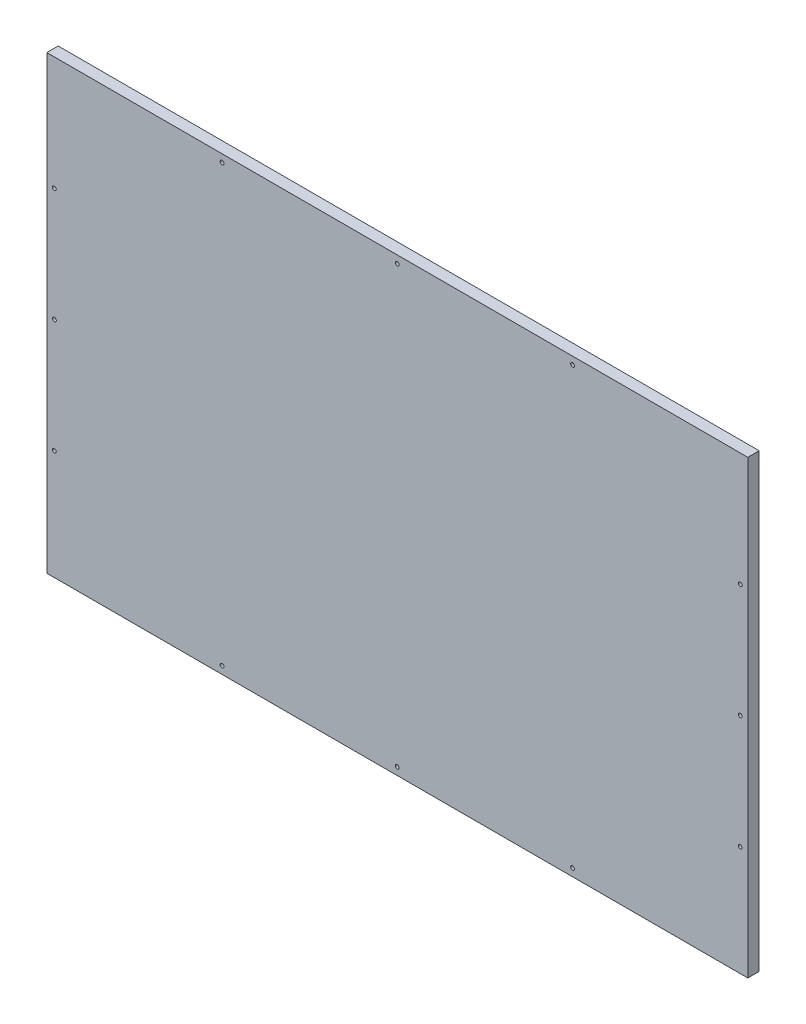
ISO-10303-21;
HEADER;
FILE_DESCRIPTION(('STEP AP214'),'2;1');
FILE_NAME('part.step','',(''),(''),'','','');
FILE_SCHEMA(('AUTOMOTIVE_DESIGN { 1 0 10303 214 1 1 1 1 }'));
ENDSEC;
DATA;
#1=APPLICATION_CONTEXT('core data for automotive mechanical design processes');
#2=APPLICATION_PROTOCOL_DEFINITION('international standard','automotive_design',2000,#1);
#3=PRODUCT_CONTEXT('',#1,'mechanical');
#4=PRODUCT('Part','Part','',(#3));
#5=PRODUCT_RELATED_PRODUCT_CATEGORY('part','',(#4));
#6=PRODUCT_DEFINITION_FORMATION('','',#4);
#7=PRODUCT_DEFINITION_CONTEXT('part definition',#1,'design');
#8=PRODUCT_DEFINITION('design','',#6,#7);
#9=PRODUCT_DEFINITION_SHAPE('','',#8);
#10=(LENGTH_UNIT() NAMED_UNIT(*) SI_UNIT(.MILLI.,.METRE.));
#11=(NAMED_UNIT(*) PLANE_ANGLE_UNIT() SI_UNIT($,.RADIAN.));
#12=(NAMED_UNIT(*) SI_UNIT($,.STERADIAN.) SOLID_ANGLE_UNIT());
#13=UNCERTAINTY_MEASURE_WITH_UNIT(LENGTH_MEASURE(1.E-05),#10,'distance_accuracy_value','');
#14=(GEOMETRIC_REPRESENTATION_CONTEXT(3) GLOBAL_UNCERTAINTY_ASSIGNED_CONTEXT((#13)) GLOBAL_UNIT_ASSIGNED_CONTEXT((#10,
#11,#12)) REPRESENTATION_CONTEXT('',''));
#15=CARTESIAN_POINT('',(0.,0.,0.));
#16=DIRECTION('',(0.,0.,1.));
#17=DIRECTION('',(1.,0.,0.));
#18=AXIS2_PLACEMENT_3D('',#15,#16,#17);
#19=CARTESIAN_POINT('',(462.5,297.5,15.));
#20=DIRECTION('',(-1.,0.,0.));
#21=DIRECTION('',(0.,-1.,0.));
#22=AXIS2_PLACEMENT_3D('',#19,#20,#21);
#23=PLANE('',#22);
#24=DIRECTION('',(0.,1.,0.));
#25=VECTOR('',#24,1.);
#26=CARTESIAN_POINT('',(462.5,297.5,0.));
#27=LINE('',#26,#25);
#28=CARTESIAN_POINT('',(462.5,-297.5,0.));
#29=VERTEX_POINT('',#28);
#30=CARTESIAN_POINT('',(462.5,297.5,0.));
#31=VERTEX_POINT('',#30);
#32=EDGE_CURVE('E100',#29,#31,#27,.T.);
#33=ORIENTED_EDGE('',*,*,#32,.T.);
#34=DIRECTION('',(0.,0.,-1.));
#35=VECTOR('',#34,1.);
#36=CARTESIAN_POINT('',(462.5,297.5,15.));
#37=LINE('',#36,#35);
#38=CARTESIAN_POINT('',(462.5,297.5,15.));
#39=VERTEX_POINT('',#38);
#40=EDGE_CURVE('E11',#39,#31,#37,.T.);
#41=ORIENTED_EDGE('',*,*,#40,.F.);
#42=DIRECTION('',(0.,1.,0.));
#43=VECTOR('',#42,1.);
#44=CARTESIAN_POINT('',(462.5,297.5,15.));
#45=LINE('',#44,#43);
#46=CARTESIAN_POINT('',(462.5,-297.5,15.));
#47=VERTEX_POINT('',#46);
#48=EDGE_CURVE('E88',#47,#39,#45,.T.);
#49=ORIENTED_EDGE('',*,*,#48,.F.);
#50=DIRECTION('',(0.,0.,-1.));
#51=VECTOR('',#50,1.);
#52=CARTESIAN_POINT('',(462.5,-297.5,15.));
#53=LINE('',#52,#51);
#54=EDGE_CURVE('E96',#47,#29,#53,.T.);
#55=ORIENTED_EDGE('',*,*,#54,.T.);
#56=EDGE_LOOP('',(#33,#41,#49,#55));
#57=FACE_BOUND('',#56,.T.);
#58=ADVANCED_FACE('F37',(#57),#23,.F.);
#59=CARTESIAN_POINT('',(-462.5,297.5,15.));
#60=DIRECTION('',(0.,-1.,0.));
#61=DIRECTION('',(0.,0.,-1.));
#62=AXIS2_PLACEMENT_3D('',#59,#60,#61);
#63=PLANE('',#62);
#64=DIRECTION('',(-1.,0.,0.));
#65=VECTOR('',#64,1.);
#66=CARTESIAN_POINT('',(-462.5,297.5,0.));
#67=LINE('',#66,#65);
#68=CARTESIAN_POINT('',(-462.5,297.5,0.));
#69=VERTEX_POINT('',#68);
#70=EDGE_CURVE('E92',#31,#69,#67,.T.);
#71=ORIENTED_EDGE('',*,*,#70,.T.);
#72=DIRECTION('',(0.,0.,-1.));
#73=VECTOR('',#72,1.);
#74=CARTESIAN_POINT('',(-462.5,297.5,15.));
#75=LINE('',#74,#73);
#76=CARTESIAN_POINT('',(-462.5,297.5,15.));
#77=VERTEX_POINT('',#76);
#78=EDGE_CURVE('E45',#77,#69,#75,.T.);
#79=ORIENTED_EDGE('',*,*,#78,.F.);
#80=DIRECTION('',(-1.,0.,0.));
#81=VECTOR('',#80,1.);
#82=CARTESIAN_POINT('',(-462.5,297.5,15.));
#83=LINE('',#82,#81);
#84=EDGE_CURVE('E83',#39,#77,#83,.T.);
#85=ORIENTED_EDGE('',*,*,#84,.F.);
#86=ORIENTED_EDGE('',*,*,#40,.T.);
#87=EDGE_LOOP('',(#71,#79,#85,#86));
#88=FACE_BOUND('',#87,.T.);
#89=ADVANCED_FACE('F91',(#88),#63,.F.);
#90=CARTESIAN_POINT('',(-462.5,297.5,15.));
#91=DIRECTION('',(1.,0.,0.));
#92=DIRECTION('',(0.,1.,0.));
#93=AXIS2_PLACEMENT_3D('',#90,#91,#92);
#94=PLANE('',#93);
#95=DIRECTION('',(0.,-1.,0.));
#96=VECTOR('',#95,1.);
#97=CARTESIAN_POINT('',(-462.5,297.5,0.));
#98=LINE('',#97,#96);
#99=CARTESIAN_POINT('',(-462.5,-297.5,0.));
#100=VERTEX_POINT('',#99);
#101=EDGE_CURVE('E70',#69,#100,#98,.T.);
#102=ORIENTED_EDGE('',*,*,#101,.T.);
#103=DIRECTION('',(0.,0.,-1.));
#104=VECTOR('',#103,1.);
#105=CARTESIAN_POINT('',(-462.5,-297.5,15.));
#106=LINE('',#105,#104);
#107=CARTESIAN_POINT('',(-462.5,-297.5,15.));
#108=VERTEX_POINT('',#107);
#109=EDGE_CURVE('E93',#108,#100,#106,.T.);
#110=ORIENTED_EDGE('',*,*,#109,.F.);
#111=DIRECTION('',(0.,-1.,0.));
#112=VECTOR('',#111,1.);
#113=CARTESIAN_POINT('',(-462.5,297.5,15.));
#114=LINE('',#113,#112);
#115=EDGE_CURVE('E86',#77,#108,#114,.T.);
#116=ORIENTED_EDGE('',*,*,#115,.F.);
#117=ORIENTED_EDGE('',*,*,#78,.T.);
#118=EDGE_LOOP('',(#102,#110,#116,#117));
#119=FACE_BOUND('',#118,.T.);
#120=ADVANCED_FACE('F94',(#119),#94,.F.);
#121=CARTESIAN_POINT('',(-462.5,-297.5,15.));
#122=DIRECTION('',(0.,1.,0.));
#123=DIRECTION('',(0.,0.,1.));
#124=AXIS2_PLACEMENT_3D('',#121,#122,#123);
#125=PLANE('',#124);
#126=DIRECTION('',(1.,0.,0.));
#127=VECTOR('',#126,1.);
#128=CARTESIAN_POINT('',(-462.5,-297.5,0.));
#129=LINE('',#128,#127);
#130=EDGE_CURVE('E76',#100,#29,#129,.T.);
#131=ORIENTED_EDGE('',*,*,#130,.T.);
#132=ORIENTED_EDGE('',*,*,#54,.F.);
#133=DIRECTION('',(1.,0.,0.));
#134=VECTOR('',#133,1.);
#135=CARTESIAN_POINT('',(-462.5,-297.5,15.));
#136=LINE('',#135,#134);
#137=EDGE_CURVE('E53',#108,#47,#136,.T.);
#138=ORIENTED_EDGE('',*,*,#137,.F.);
#139=ORIENTED_EDGE('',*,*,#109,.T.);
#140=EDGE_LOOP('',(#131,#132,#138,#139));
#141=FACE_BOUND('',#140,.T.);
#142=ADVANCED_FACE('F108',(#141),#125,.F.);
#143=CARTESIAN_POINT('',(0.,0.,15.));
#144=DIRECTION('',(0.,0.,1.));
#145=DIRECTION('',(1.,0.,0.));
#146=AXIS2_PLACEMENT_3D('',#143,#144,#145);
#147=PLANE('',#146);
#148=CARTESIAN_POINT('',(452.5,147.5,15.));
#149=DIRECTION('',(0.,0.,-1.));
#150=DIRECTION('',(-1.,0.,0.));
#151=AXIS2_PLACEMENT_3D('',#148,#149,#150);
#152=CIRCLE('',#151,2.50000000000002);
#153=CARTESIAN_POINT('',(450.,147.5,15.));
#154=VERTEX_POINT('',#153);
#155=EDGE_CURVE('E180',#154,#154,#152,.T.);
#156=ORIENTED_EDGE('',*,*,#155,.T.);
#157=EDGE_LOOP('',(#156));
#158=FACE_BOUND('',#157,.T.);
#159=CARTESIAN_POINT('',(452.5,-2.5,15.));
#160=DIRECTION('',(0.,0.,-1.));
#161=DIRECTION('',(-1.,0.,0.));
#162=AXIS2_PLACEMENT_3D('',#159,#160,#161);
#163=CIRCLE('',#162,2.50000000000002);
#164=CARTESIAN_POINT('',(450.,-2.5,15.));
#165=VERTEX_POINT('',#164);
#166=EDGE_CURVE('E174',#165,#165,#163,.T.);
#167=ORIENTED_EDGE('',*,*,#166,.T.);
#168=EDGE_LOOP('',(#167));
#169=FACE_BOUND('',#168,.T.);
#170=CARTESIAN_POINT('',(452.5,-152.5,15.));
#171=DIRECTION('',(0.,0.,-1.));
#172=DIRECTION('',(-1.,0.,0.));
#173=AXIS2_PLACEMENT_3D('',#170,#171,#172);
#174=CIRCLE('',#173,2.50000000000002);
#175=CARTESIAN_POINT('',(450.,-152.5,15.));
#176=VERTEX_POINT('',#175);
#177=EDGE_CURVE('E168',#176,#176,#174,.T.);
#178=ORIENTED_EDGE('',*,*,#177,.T.);
#179=EDGE_LOOP('',(#178));
#180=FACE_BOUND('',#179,.T.);
#181=CARTESIAN_POINT('',(-231.25,-287.5,15.));
#182=DIRECTION('',(0.,0.,-1.));
#183=DIRECTION('',(1.,0.,0.));
#184=AXIS2_PLACEMENT_3D('',#181,#182,#183);
#185=CIRCLE('',#184,2.50000000000002);
#186=CARTESIAN_POINT('',(-228.75,-287.5,15.));
#187=VERTEX_POINT('',#186);
#188=EDGE_CURVE('E163',#187,#187,#185,.T.);
#189=ORIENTED_EDGE('',*,*,#188,.T.);
#190=EDGE_LOOP('',(#189));
#191=FACE_BOUND('',#190,.T.);
#192=CARTESIAN_POINT('',(0.,-287.5,15.));
#193=DIRECTION('',(0.,0.,-1.));
#194=DIRECTION('',(1.,0.,0.));
#195=AXIS2_PLACEMENT_3D('',#192,#193,#194);
#196=CIRCLE('',#195,2.49999999999993);
#197=CARTESIAN_POINT('',(2.49999999999985,-287.5,15.));
#198=VERTEX_POINT('',#197);
#199=EDGE_CURVE('E157',#198,#198,#196,.T.);
#200=ORIENTED_EDGE('',*,*,#199,.T.);
#201=EDGE_LOOP('',(#200));
#202=FACE_BOUND('',#201,.T.);
#203=CARTESIAN_POINT('',(231.25,-287.5,15.));
#204=DIRECTION('',(0.,0.,-1.));
#205=DIRECTION('',(1.,0.,0.));
#206=AXIS2_PLACEMENT_3D('',#203,#204,#205);
#207=CIRCLE('',#206,2.49999999999992);
#208=CARTESIAN_POINT('',(233.75,-287.5,15.));
#209=VERTEX_POINT('',#208);
#210=EDGE_CURVE('E150',#209,#209,#207,.T.);
#211=ORIENTED_EDGE('',*,*,#210,.T.);
#212=EDGE_LOOP('',(#211));
#213=FACE_BOUND('',#212,.T.);
#214=CARTESIAN_POINT('',(-452.5,147.5,15.));
#215=DIRECTION('',(0.,0.,1.));
#216=DIRECTION('',(1.,0.,0.));
#217=AXIS2_PLACEMENT_3D('',#214,#215,#216);
#218=CIRCLE('',#217,2.50000000000002);
#219=CARTESIAN_POINT('',(-450.,147.5,15.));
#220=VERTEX_POINT('',#219);
#221=EDGE_CURVE('E145',#220,#220,#218,.T.);
#222=ORIENTED_EDGE('',*,*,#221,.F.);
#223=EDGE_LOOP('',(#222));
#224=FACE_BOUND('',#223,.T.);
#225=CARTESIAN_POINT('',(-452.5,-2.5,15.));
#226=DIRECTION('',(0.,0.,1.));
#227=DIRECTION('',(1.,0.,0.));
#228=AXIS2_PLACEMENT_3D('',#225,#226,#227);
#229=CIRCLE('',#228,2.50000000000002);
#230=CARTESIAN_POINT('',(-450.,-2.5,15.));
#231=VERTEX_POINT('',#230);
#232=EDGE_CURVE('E142',#231,#231,#229,.T.);
#233=ORIENTED_EDGE('',*,*,#232,.F.);
#234=EDGE_LOOP('',(#233));
#235=FACE_BOUND('',#234,.T.);
#236=CARTESIAN_POINT('',(-452.5,-152.5,15.));
#237=DIRECTION('',(0.,0.,1.));
#238=DIRECTION('',(1.,0.,0.));
#239=AXIS2_PLACEMENT_3D('',#236,#237,#238);
#240=CIRCLE('',#239,2.50000000000002);
#241=CARTESIAN_POINT('',(-450.,-152.5,15.));
#242=VERTEX_POINT('',#241);
#243=EDGE_CURVE('E135',#242,#242,#240,.T.);
#244=ORIENTED_EDGE('',*,*,#243,.F.);
#245=EDGE_LOOP('',(#244));
#246=FACE_BOUND('',#245,.T.);
#247=CARTESIAN_POINT('',(-231.25,287.5,15.));
#248=DIRECTION('',(0.,0.,1.));
#249=DIRECTION('',(1.,0.,0.));
#250=AXIS2_PLACEMENT_3D('',#247,#248,#249);
#251=CIRCLE('',#250,2.50000000000002);
#252=CARTESIAN_POINT('',(-228.75,287.5,15.));
#253=VERTEX_POINT('',#252);
#254=EDGE_CURVE('E127',#253,#253,#251,.T.);
#255=ORIENTED_EDGE('',*,*,#254,.F.);
#256=EDGE_LOOP('',(#255));
#257=FACE_BOUND('',#256,.T.);
#258=CARTESIAN_POINT('',(0.,287.5,15.));
#259=DIRECTION('',(0.,0.,1.));
#260=DIRECTION('',(1.,0.,0.));
#261=AXIS2_PLACEMENT_3D('',#258,#259,#260);
#262=CIRCLE('',#261,2.49999999999993);
#263=CARTESIAN_POINT('',(2.49999999999985,287.5,15.));
#264=VERTEX_POINT('',#263);
#265=EDGE_CURVE('E124',#264,#264,#262,.T.);
#266=ORIENTED_EDGE('',*,*,#265,.F.);
#267=EDGE_LOOP('',(#266));
#268=FACE_BOUND('',#267,.T.);
#269=CARTESIAN_POINT('',(231.25,287.5,15.));
#270=DIRECTION('',(0.,0.,1.));
#271=DIRECTION('',(1.,0.,0.));
#272=AXIS2_PLACEMENT_3D('',#269,#270,#271);
#273=CIRCLE('',#272,2.49999999999992);
#274=CARTESIAN_POINT('',(233.75,287.5,15.));
#275=VERTEX_POINT('',#274);
#276=EDGE_CURVE('E117',#275,#275,#273,.T.);
#277=ORIENTED_EDGE('',*,*,#276,.F.);
#278=EDGE_LOOP('',(#277));
#279=FACE_BOUND('',#278,.T.);
#280=ORIENTED_EDGE('',*,*,#48,.T.);
#281=ORIENTED_EDGE('',*,*,#84,.T.);
#282=ORIENTED_EDGE('',*,*,#115,.T.);
#283=ORIENTED_EDGE('',*,*,#137,.T.);
#284=EDGE_LOOP('',(#280,#281,#282,#283));
#285=FACE_BOUND('',#284,.T.);
#286=ADVANCED_FACE('F84',(#158,#169,#180,#191,#202,#213,#224,#235,#246,#257,#268,#279,#285),
#147,.T.);
#287=CARTESIAN_POINT('',(0.,0.,0.));
#288=DIRECTION('',(0.,0.,1.));
#289=DIRECTION('',(1.,0.,0.));
#290=AXIS2_PLACEMENT_3D('',#287,#288,#289);
#291=PLANE('',#290);
#292=CARTESIAN_POINT('',(452.5,147.5,0.));
#293=DIRECTION('',(0.,0.,-1.));
#294=DIRECTION('',(-1.,0.,0.));
#295=AXIS2_PLACEMENT_3D('',#292,#293,#294);
#296=CIRCLE('',#295,2.50000000000002);
#297=CARTESIAN_POINT('',(450.,147.5,0.));
#298=VERTEX_POINT('',#297);
#299=EDGE_CURVE('E154',#298,#298,#296,.T.);
#300=ORIENTED_EDGE('',*,*,#299,.F.);
#301=EDGE_LOOP('',(#300));
#302=FACE_BOUND('',#301,.T.);
#303=CARTESIAN_POINT('',(452.5,-2.5,0.));
#304=DIRECTION('',(0.,0.,-1.));
#305=DIRECTION('',(-1.,0.,0.));
#306=AXIS2_PLACEMENT_3D('',#303,#304,#305);
#307=CIRCLE('',#306,2.50000000000002);
#308=CARTESIAN_POINT('',(450.,-2.5,0.));
#309=VERTEX_POINT('',#308);
#310=EDGE_CURVE('E177',#309,#309,#307,.T.);
#311=ORIENTED_EDGE('',*,*,#310,.F.);
#312=EDGE_LOOP('',(#311));
#313=FACE_BOUND('',#312,.T.);
#314=CARTESIAN_POINT('',(452.5,-152.5,0.));
#315=DIRECTION('',(0.,0.,-1.));
#316=DIRECTION('',(-1.,0.,0.));
#317=AXIS2_PLACEMENT_3D('',#314,#315,#316);
#318=CIRCLE('',#317,2.50000000000002);
#319=CARTESIAN_POINT('',(450.,-152.5,0.));
#320=VERTEX_POINT('',#319);
#321=EDGE_CURVE('E171',#320,#320,#318,.T.);
#322=ORIENTED_EDGE('',*,*,#321,.F.);
#323=EDGE_LOOP('',(#322));
#324=FACE_BOUND('',#323,.T.);
#325=CARTESIAN_POINT('',(-231.25,-287.5,0.));
#326=DIRECTION('',(0.,0.,-1.));
#327=DIRECTION('',(1.,0.,0.));
#328=AXIS2_PLACEMENT_3D('',#325,#326,#327);
#329=CIRCLE('',#328,2.50000000000002);
#330=CARTESIAN_POINT('',(-228.75,-287.5,0.));
#331=VERTEX_POINT('',#330);
#332=EDGE_CURVE('E136',#331,#331,#329,.T.);
#333=ORIENTED_EDGE('',*,*,#332,.F.);
#334=EDGE_LOOP('',(#333));
#335=FACE_BOUND('',#334,.T.);
#336=CARTESIAN_POINT('',(0.,-287.5,0.));
#337=DIRECTION('',(0.,0.,-1.));
#338=DIRECTION('',(1.,0.,0.));
#339=AXIS2_PLACEMENT_3D('',#336,#337,#338);
#340=CIRCLE('',#339,2.49999999999993);
#341=CARTESIAN_POINT('',(2.49999999999985,-287.5,0.));
#342=VERTEX_POINT('',#341);
#343=EDGE_CURVE('E160',#342,#342,#340,.T.);
#344=ORIENTED_EDGE('',*,*,#343,.F.);
#345=EDGE_LOOP('',(#344));
#346=FACE_BOUND('',#345,.T.);
#347=CARTESIAN_POINT('',(231.25,-287.5,0.));
#348=DIRECTION('',(0.,0.,-1.));
#349=DIRECTION('',(1.,0.,0.));
#350=AXIS2_PLACEMENT_3D('',#347,#348,#349);
#351=CIRCLE('',#350,2.49999999999992);
#352=CARTESIAN_POINT('',(233.75,-287.5,0.));
#353=VERTEX_POINT('',#352);
#354=EDGE_CURVE('E153',#353,#353,#351,.T.);
#355=ORIENTED_EDGE('',*,*,#354,.F.);
#356=EDGE_LOOP('',(#355));
#357=FACE_BOUND('',#356,.T.);
#358=CARTESIAN_POINT('',(-452.5,147.5,0.));
#359=DIRECTION('',(0.,0.,1.));
#360=DIRECTION('',(1.,0.,0.));
#361=AXIS2_PLACEMENT_3D('',#358,#359,#360);
#362=CIRCLE('',#361,2.50000000000002);
#363=CARTESIAN_POINT('',(-450.,147.5,0.));
#364=VERTEX_POINT('',#363);
#365=EDGE_CURVE('E118',#364,#364,#362,.T.);
#366=ORIENTED_EDGE('',*,*,#365,.T.);
#367=EDGE_LOOP('',(#366));
#368=FACE_BOUND('',#367,.T.);
#369=CARTESIAN_POINT('',(-452.5,-2.5,0.));
#370=DIRECTION('',(0.,0.,1.));
#371=DIRECTION('',(1.,0.,0.));
#372=AXIS2_PLACEMENT_3D('',#369,#370,#371);
#373=CIRCLE('',#372,2.50000000000002);
#374=CARTESIAN_POINT('',(-450.,-2.5,0.));
#375=VERTEX_POINT('',#374);
#376=EDGE_CURVE('E139',#375,#375,#373,.T.);
#377=ORIENTED_EDGE('',*,*,#376,.T.);
#378=EDGE_LOOP('',(#377));
#379=FACE_BOUND('',#378,.T.);
#380=CARTESIAN_POINT('',(-452.5,-152.5,0.));
#381=DIRECTION('',(0.,0.,1.));
#382=DIRECTION('',(1.,0.,0.));
#383=AXIS2_PLACEMENT_3D('',#380,#381,#382);
#384=CIRCLE('',#383,2.50000000000002);
#385=CARTESIAN_POINT('',(-450.,-152.5,0.));
#386=VERTEX_POINT('',#385);
#387=EDGE_CURVE('E132',#386,#386,#384,.T.);
#388=ORIENTED_EDGE('',*,*,#387,.T.);
#389=EDGE_LOOP('',(#388));
#390=FACE_BOUND('',#389,.T.);
#391=CARTESIAN_POINT('',(-231.25,287.5,0.));
#392=DIRECTION('',(0.,0.,1.));
#393=DIRECTION('',(1.,0.,0.));
#394=AXIS2_PLACEMENT_3D('',#391,#392,#393);
#395=CIRCLE('',#394,2.50000000000002);
#396=CARTESIAN_POINT('',(-228.75,287.5,0.));
#397=VERTEX_POINT('',#396);
#398=EDGE_CURVE('E103',#397,#397,#395,.T.);
#399=ORIENTED_EDGE('',*,*,#398,.T.);
#400=EDGE_LOOP('',(#399));
#401=FACE_BOUND('',#400,.T.);
#402=CARTESIAN_POINT('',(0.,287.5,0.));
#403=DIRECTION('',(0.,0.,1.));
#404=DIRECTION('',(1.,0.,0.));
#405=AXIS2_PLACEMENT_3D('',#402,#403,#404);
#406=CIRCLE('',#405,2.49999999999993);
#407=CARTESIAN_POINT('',(2.49999999999985,287.5,0.));
#408=VERTEX_POINT('',#407);
#409=EDGE_CURVE('E121',#408,#408,#406,.T.);
#410=ORIENTED_EDGE('',*,*,#409,.T.);
#411=EDGE_LOOP('',(#410));
#412=FACE_BOUND('',#411,.T.);
#413=CARTESIAN_POINT('',(231.25,287.5,0.));
#414=DIRECTION('',(0.,0.,1.));
#415=DIRECTION('',(1.,0.,0.));
#416=AXIS2_PLACEMENT_3D('',#413,#414,#415);
#417=CIRCLE('',#416,2.49999999999992);
#418=CARTESIAN_POINT('',(233.75,287.5,0.));
#419=VERTEX_POINT('',#418);
#420=EDGE_CURVE('E114',#419,#419,#417,.T.);
#421=ORIENTED_EDGE('',*,*,#420,.T.);
#422=EDGE_LOOP('',(#421));
#423=FACE_BOUND('',#422,.T.);
#424=ORIENTED_EDGE('',*,*,#32,.F.);
#425=ORIENTED_EDGE('',*,*,#130,.F.);
#426=ORIENTED_EDGE('',*,*,#101,.F.);
#427=ORIENTED_EDGE('',*,*,#70,.F.);
#428=EDGE_LOOP('',(#424,#425,#426,#427));
#429=FACE_BOUND('',#428,.T.);
#430=ADVANCED_FACE('F111',(#302,#313,#324,#335,#346,#357,#368,#379,#390,#401,#412,#423,#429),
#291,.F.);
#431=CARTESIAN_POINT('',(231.25,287.5,0.));
#432=DIRECTION('',(0.,0.,1.));
#433=DIRECTION('',(1.,0.,0.));
#434=AXIS2_PLACEMENT_3D('',#431,#432,#433);
#435=CYLINDRICAL_SURFACE('',#434,2.49999999999992);
#436=ORIENTED_EDGE('',*,*,#420,.F.);
#437=EDGE_LOOP('',(#436));
#438=FACE_BOUND('',#437,.T.);
#439=ORIENTED_EDGE('',*,*,#276,.T.);
#440=EDGE_LOOP('',(#439));
#441=FACE_BOUND('',#440,.T.);
#442=ADVANCED_FACE('F191',(#438,#441),#435,.F.);
#443=CARTESIAN_POINT('',(0.,287.5,0.));
#444=DIRECTION('',(0.,0.,1.));
#445=DIRECTION('',(1.,0.,0.));
#446=AXIS2_PLACEMENT_3D('',#443,#444,#445);
#447=CYLINDRICAL_SURFACE('',#446,2.49999999999993);
#448=ORIENTED_EDGE('',*,*,#409,.F.);
#449=EDGE_LOOP('',(#448));
#450=FACE_BOUND('',#449,.T.);
#451=ORIENTED_EDGE('',*,*,#265,.T.);
#452=EDGE_LOOP('',(#451));
#453=FACE_BOUND('',#452,.T.);
#454=ADVANCED_FACE('F217',(#450,#453),#447,.F.);
#455=CARTESIAN_POINT('',(-231.25,287.5,0.));
#456=DIRECTION('',(0.,0.,1.));
#457=DIRECTION('',(1.,0.,0.));
#458=AXIS2_PLACEMENT_3D('',#455,#456,#457);
#459=CYLINDRICAL_SURFACE('',#458,2.50000000000002);
#460=ORIENTED_EDGE('',*,*,#398,.F.);
#461=EDGE_LOOP('',(#460));
#462=FACE_BOUND('',#461,.T.);
#463=ORIENTED_EDGE('',*,*,#254,.T.);
#464=EDGE_LOOP('',(#463));
#465=FACE_BOUND('',#464,.T.);
#466=ADVANCED_FACE('F262',(#462,#465),#459,.F.);
#467=CARTESIAN_POINT('',(-452.5,-152.5,0.));
#468=DIRECTION('',(0.,0.,1.));
#469=DIRECTION('',(1.,0.,0.));
#470=AXIS2_PLACEMENT_3D('',#467,#468,#469);
#471=CYLINDRICAL_SURFACE('',#470,2.50000000000002);
#472=ORIENTED_EDGE('',*,*,#387,.F.);
#473=EDGE_LOOP('',(#472));
#474=FACE_BOUND('',#473,.T.);
#475=ORIENTED_EDGE('',*,*,#243,.T.);
#476=EDGE_LOOP('',(#475));
#477=FACE_BOUND('',#476,.T.);
#478=ADVANCED_FACE('F273',(#474,#477),#471,.F.);
#479=CARTESIAN_POINT('',(-452.5,-2.5,0.));
#480=DIRECTION('',(0.,0.,1.));
#481=DIRECTION('',(1.,0.,0.));
#482=AXIS2_PLACEMENT_3D('',#479,#480,#481);
#483=CYLINDRICAL_SURFACE('',#482,2.50000000000002);
#484=ORIENTED_EDGE('',*,*,#376,.F.);
#485=EDGE_LOOP('',(#484));
#486=FACE_BOUND('',#485,.T.);
#487=ORIENTED_EDGE('',*,*,#232,.T.);
#488=EDGE_LOOP('',(#487));
#489=FACE_BOUND('',#488,.T.);
#490=ADVANCED_FACE('F284',(#486,#489),#483,.F.);
#491=CARTESIAN_POINT('',(-452.5,147.5,0.));
#492=DIRECTION('',(0.,0.,1.));
#493=DIRECTION('',(1.,0.,0.));
#494=AXIS2_PLACEMENT_3D('',#491,#492,#493);
#495=CYLINDRICAL_SURFACE('',#494,2.50000000000002);
#496=ORIENTED_EDGE('',*,*,#365,.F.);
#497=EDGE_LOOP('',(#496));
#498=FACE_BOUND('',#497,.T.);
#499=ORIENTED_EDGE('',*,*,#221,.T.);
#500=EDGE_LOOP('',(#499));
#501=FACE_BOUND('',#500,.T.);
#502=ADVANCED_FACE('F295',(#498,#501),#495,.F.);
#503=CARTESIAN_POINT('',(231.25,-287.5,0.));
#504=DIRECTION('',(0.,0.,1.));
#505=DIRECTION('',(1.,0.,0.));
#506=AXIS2_PLACEMENT_3D('',#503,#504,#505);
#507=CYLINDRICAL_SURFACE('',#506,2.49999999999992);
#508=ORIENTED_EDGE('',*,*,#354,.T.);
#509=EDGE_LOOP('',(#508));
#510=FACE_BOUND('',#509,.T.);
#511=ORIENTED_EDGE('',*,*,#210,.F.);
#512=EDGE_LOOP('',(#511));
#513=FACE_BOUND('',#512,.T.);
#514=ADVANCED_FACE('F306',(#510,#513),#507,.F.);
#515=CARTESIAN_POINT('',(0.,-287.5,0.));
#516=DIRECTION('',(0.,0.,1.));
#517=DIRECTION('',(1.,0.,0.));
#518=AXIS2_PLACEMENT_3D('',#515,#516,#517);
#519=CYLINDRICAL_SURFACE('',#518,2.49999999999993);
#520=ORIENTED_EDGE('',*,*,#343,.T.);
#521=EDGE_LOOP('',(#520));
#522=FACE_BOUND('',#521,.T.);
#523=ORIENTED_EDGE('',*,*,#199,.F.);
#524=EDGE_LOOP('',(#523));
#525=FACE_BOUND('',#524,.T.);
#526=ADVANCED_FACE('F317',(#522,#525),#519,.F.);
#527=CARTESIAN_POINT('',(-231.25,-287.5,0.));
#528=DIRECTION('',(0.,0.,1.));
#529=DIRECTION('',(1.,0.,0.));
#530=AXIS2_PLACEMENT_3D('',#527,#528,#529);
#531=CYLINDRICAL_SURFACE('',#530,2.50000000000002);
#532=ORIENTED_EDGE('',*,*,#332,.T.);
#533=EDGE_LOOP('',(#532));
#534=FACE_BOUND('',#533,.T.);
#535=ORIENTED_EDGE('',*,*,#188,.F.);
#536=EDGE_LOOP('',(#535));
#537=FACE_BOUND('',#536,.T.);
#538=ADVANCED_FACE('F328',(#534,#537),#531,.F.);
#539=CARTESIAN_POINT('',(452.5,-152.5,0.));
#540=DIRECTION('',(0.,0.,1.));
#541=DIRECTION('',(1.,0.,0.));
#542=AXIS2_PLACEMENT_3D('',#539,#540,#541);
#543=CYLINDRICAL_SURFACE('',#542,2.50000000000002);
#544=ORIENTED_EDGE('',*,*,#321,.T.);
#545=EDGE_LOOP('',(#544));
#546=FACE_BOUND('',#545,.T.);
#547=ORIENTED_EDGE('',*,*,#177,.F.);
#548=EDGE_LOOP('',(#547));
#549=FACE_BOUND('',#548,.T.);
#550=ADVANCED_FACE('F338',(#546,#549),#543,.F.);
#551=CARTESIAN_POINT('',(452.5,-2.5,0.));
#552=DIRECTION('',(0.,0.,1.));
#553=DIRECTION('',(1.,0.,0.));
#554=AXIS2_PLACEMENT_3D('',#551,#552,#553);
#555=CYLINDRICAL_SURFACE('',#554,2.50000000000002);
#556=ORIENTED_EDGE('',*,*,#310,.T.);
#557=EDGE_LOOP('',(#556));
#558=FACE_BOUND('',#557,.T.);
#559=ORIENTED_EDGE('',*,*,#166,.F.);
#560=EDGE_LOOP('',(#559));
#561=FACE_BOUND('',#560,.T.);
#562=ADVANCED_FACE('F360',(#558,#561),#555,.F.);
#563=CARTESIAN_POINT('',(452.5,147.5,0.));
#564=DIRECTION('',(0.,0.,1.));
#565=DIRECTION('',(1.,0.,0.));
#566=AXIS2_PLACEMENT_3D('',#563,#564,#565);
#567=CYLINDRICAL_SURFACE('',#566,2.50000000000002);
#568=ORIENTED_EDGE('',*,*,#299,.T.);
#569=EDGE_LOOP('',(#568));
#570=FACE_BOUND('',#569,.T.);
#571=ORIENTED_EDGE('',*,*,#155,.F.);
#572=EDGE_LOOP('',(#571));
#573=FACE_BOUND('',#572,.T.);
#574=ADVANCED_FACE('F186',(#570,#573),#567,.F.);
#575=CLOSED_SHELL('',(#58,#89,#120,#142,#286,#430,#442,#454,#466,#478,#490,#502,#514,#526,#538,
#550,#562,#574));
#576=MANIFOLD_SOLID_BREP('B2',#575);
#577=ADVANCED_BREP_SHAPE_REPRESENTATION('',(#18,#576),#14);
#578=SHAPE_DEFINITION_REPRESENTATION(#9,#577);
ENDSEC;
END-ISO-10303-21;
